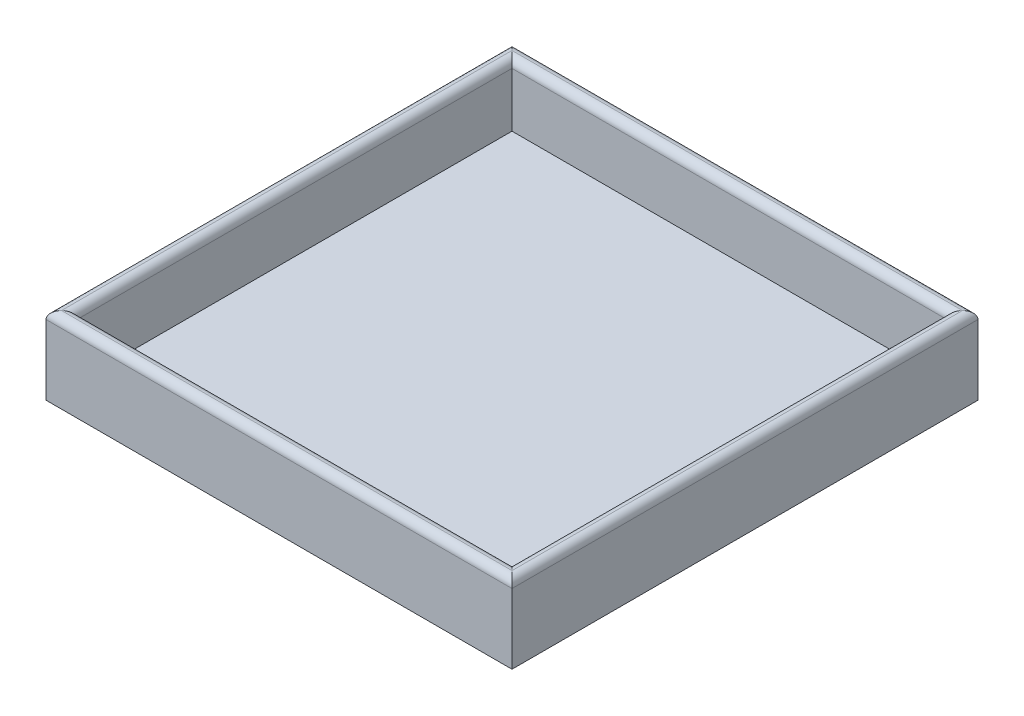
ISO-10303-21;
HEADER;
FILE_DESCRIPTION(('STEP AP214'),'2;1');
FILE_NAME('part.step','',(''),(''),'','','');
FILE_SCHEMA(('AUTOMOTIVE_DESIGN { 1 0 10303 214 1 1 1 1 }'));
ENDSEC;
DATA;
#1=APPLICATION_CONTEXT('core data for automotive mechanical design processes');
#2=APPLICATION_PROTOCOL_DEFINITION('international standard','automotive_design',2000,#1);
#3=PRODUCT_CONTEXT('',#1,'mechanical');
#4=PRODUCT('Part','Part','',(#3));
#5=PRODUCT_RELATED_PRODUCT_CATEGORY('part','',(#4));
#6=PRODUCT_DEFINITION_FORMATION('','',#4);
#7=PRODUCT_DEFINITION_CONTEXT('part definition',#1,'design');
#8=PRODUCT_DEFINITION('design','',#6,#7);
#9=PRODUCT_DEFINITION_SHAPE('','',#8);
#10=(LENGTH_UNIT() NAMED_UNIT(*) SI_UNIT(.MILLI.,.METRE.));
#11=(NAMED_UNIT(*) PLANE_ANGLE_UNIT() SI_UNIT($,.RADIAN.));
#12=(NAMED_UNIT(*) SI_UNIT($,.STERADIAN.) SOLID_ANGLE_UNIT());
#13=UNCERTAINTY_MEASURE_WITH_UNIT(LENGTH_MEASURE(1.E-05),#10,'distance_accuracy_value','');
#14=(GEOMETRIC_REPRESENTATION_CONTEXT(3) GLOBAL_UNCERTAINTY_ASSIGNED_CONTEXT((#13)) GLOBAL_UNIT_ASSIGNED_CONTEXT((#10,
#11,#12)) REPRESENTATION_CONTEXT('',''));
#15=CARTESIAN_POINT('',(0.,0.,0.));
#16=DIRECTION('',(0.,0.,1.));
#17=DIRECTION('',(1.,0.,0.));
#18=AXIS2_PLACEMENT_3D('',#15,#16,#17);
#19=CARTESIAN_POINT('',(0.,50.,0.));
#20=DIRECTION('',(-1.,0.,0.));
#21=DIRECTION('',(0.,0.,1.));
#22=AXIS2_PLACEMENT_3D('',#19,#20,#21);
#23=PLANE('',#22);
#24=DIRECTION('',(0.,-1.,0.));
#25=VECTOR('',#24,1.);
#26=CARTESIAN_POINT('',(0.,50.,0.));
#27=LINE('',#26,#25);
#28=CARTESIAN_POINT('',(0.,45.,0.));
#29=VERTEX_POINT('',#28);
#30=CARTESIAN_POINT('',(0.,0.,0.));
#31=VERTEX_POINT('',#30);
#32=EDGE_CURVE('E261',#29,#31,#27,.T.);
#33=ORIENTED_EDGE('',*,*,#32,.F.);
#34=DIRECTION('',(0.,0.,-1.));
#35=VECTOR('',#34,1.);
#36=CARTESIAN_POINT('',(0.,45.,-300.));
#37=LINE('',#36,#35);
#38=CARTESIAN_POINT('',(0.,45.,-300.));
#39=VERTEX_POINT('',#38);
#40=EDGE_CURVE('E174',#29,#39,#37,.T.);
#41=ORIENTED_EDGE('',*,*,#40,.T.);
#42=DIRECTION('',(0.,-1.,0.));
#43=VECTOR('',#42,1.);
#44=CARTESIAN_POINT('',(0.,50.,-300.));
#45=LINE('',#44,#43);
#46=CARTESIAN_POINT('',(0.,0.,-300.));
#47=VERTEX_POINT('',#46);
#48=EDGE_CURVE('E260',#39,#47,#45,.T.);
#49=ORIENTED_EDGE('',*,*,#48,.T.);
#50=DIRECTION('',(0.,0.,-1.));
#51=VECTOR('',#50,1.);
#52=CARTESIAN_POINT('',(0.,0.,0.));
#53=LINE('',#52,#51);
#54=EDGE_CURVE('E161',#31,#47,#53,.T.);
#55=ORIENTED_EDGE('',*,*,#54,.F.);
#56=EDGE_LOOP('',(#33,#41,#49,#55));
#57=FACE_BOUND('',#56,.T.);
#58=ADVANCED_FACE('F63',(#57),#23,.T.);
#59=CARTESIAN_POINT('',(0.,50.,0.));
#60=DIRECTION('',(0.,0.,-1.));
#61=DIRECTION('',(-1.,0.,0.));
#62=AXIS2_PLACEMENT_3D('',#59,#60,#61);
#63=PLANE('',#62);
#64=DIRECTION('',(0.,-1.,0.));
#65=VECTOR('',#64,1.);
#66=CARTESIAN_POINT('',(300.,50.,0.));
#67=LINE('',#66,#65);
#68=CARTESIAN_POINT('',(300.,45.,0.));
#69=VERTEX_POINT('',#68);
#70=CARTESIAN_POINT('',(300.,0.,0.));
#71=VERTEX_POINT('',#70);
#72=EDGE_CURVE('E265',#69,#71,#67,.T.);
#73=ORIENTED_EDGE('',*,*,#72,.F.);
#74=DIRECTION('',(1.,0.,0.));
#75=VECTOR('',#74,1.);
#76=CARTESIAN_POINT('',(0.,45.,0.));
#77=LINE('',#76,#75);
#78=EDGE_CURVE('E179',#69,#29,#77,.F.);
#79=ORIENTED_EDGE('',*,*,#78,.T.);
#80=ORIENTED_EDGE('',*,*,#32,.T.);
#81=DIRECTION('',(1.,0.,0.));
#82=VECTOR('',#81,1.);
#83=CARTESIAN_POINT('',(0.,0.,0.));
#84=LINE('',#83,#82);
#85=EDGE_CURVE('E256',#31,#71,#84,.T.);
#86=ORIENTED_EDGE('',*,*,#85,.T.);
#87=EDGE_LOOP('',(#73,#79,#80,#86));
#88=FACE_BOUND('',#87,.T.);
#89=ADVANCED_FACE('F283',(#88),#63,.F.);
#90=CARTESIAN_POINT('',(300.,50.,0.));
#91=DIRECTION('',(-1.,0.,0.));
#92=DIRECTION('',(0.,0.,1.));
#93=AXIS2_PLACEMENT_3D('',#90,#91,#92);
#94=PLANE('',#93);
#95=DIRECTION('',(0.,-1.,0.));
#96=VECTOR('',#95,1.);
#97=CARTESIAN_POINT('',(300.,50.,-300.));
#98=LINE('',#97,#96);
#99=CARTESIAN_POINT('',(300.,45.,-300.));
#100=VERTEX_POINT('',#99);
#101=CARTESIAN_POINT('',(300.,0.,-300.));
#102=VERTEX_POINT('',#101);
#103=EDGE_CURVE('E268',#100,#102,#98,.T.);
#104=ORIENTED_EDGE('',*,*,#103,.F.);
#105=DIRECTION('',(0.,0.,-1.));
#106=VECTOR('',#105,1.);
#107=CARTESIAN_POINT('',(300.,45.,0.));
#108=LINE('',#107,#106);
#109=EDGE_CURVE('E276',#100,#69,#108,.F.);
#110=ORIENTED_EDGE('',*,*,#109,.T.);
#111=ORIENTED_EDGE('',*,*,#72,.T.);
#112=DIRECTION('',(0.,0.,-1.));
#113=VECTOR('',#112,1.);
#114=CARTESIAN_POINT('',(300.,0.,0.));
#115=LINE('',#114,#113);
#116=EDGE_CURVE('E252',#71,#102,#115,.T.);
#117=ORIENTED_EDGE('',*,*,#116,.T.);
#118=EDGE_LOOP('',(#104,#110,#111,#117));
#119=FACE_BOUND('',#118,.T.);
#120=ADVANCED_FACE('F304',(#119),#94,.F.);
#121=CARTESIAN_POINT('',(0.,50.,-300.));
#122=DIRECTION('',(0.,0.,-1.));
#123=DIRECTION('',(-1.,0.,0.));
#124=AXIS2_PLACEMENT_3D('',#121,#122,#123);
#125=PLANE('',#124);
#126=ORIENTED_EDGE('',*,*,#48,.F.);
#127=DIRECTION('',(1.,0.,0.));
#128=VECTOR('',#127,1.);
#129=CARTESIAN_POINT('',(300.,45.,-300.));
#130=LINE('',#129,#128);
#131=EDGE_CURVE('E264',#39,#100,#130,.T.);
#132=ORIENTED_EDGE('',*,*,#131,.T.);
#133=ORIENTED_EDGE('',*,*,#103,.T.);
#134=DIRECTION('',(1.,0.,0.));
#135=VECTOR('',#134,1.);
#136=CARTESIAN_POINT('',(0.,0.,-300.));
#137=LINE('',#136,#135);
#138=EDGE_CURVE('E248',#47,#102,#137,.T.);
#139=ORIENTED_EDGE('',*,*,#138,.F.);
#140=EDGE_LOOP('',(#126,#132,#133,#139));
#141=FACE_BOUND('',#140,.T.);
#142=ADVANCED_FACE('F301',(#141),#125,.T.);
#143=CARTESIAN_POINT('',(0.,0.,0.));
#144=DIRECTION('',(0.,-1.,0.));
#145=DIRECTION('',(0.,0.,-1.));
#146=AXIS2_PLACEMENT_3D('',#143,#144,#145);
#147=PLANE('',#146);
#148=ORIENTED_EDGE('',*,*,#54,.T.);
#149=ORIENTED_EDGE('',*,*,#138,.T.);
#150=ORIENTED_EDGE('',*,*,#116,.F.);
#151=ORIENTED_EDGE('',*,*,#85,.F.);
#152=EDGE_LOOP('',(#148,#149,#150,#151));
#153=FACE_BOUND('',#152,.T.);
#154=ADVANCED_FACE('F307',(#153),#147,.T.);
#155=CARTESIAN_POINT('',(10.,10.,0.));
#156=DIRECTION('',(-1.,0.,0.));
#157=DIRECTION('',(0.,0.,1.));
#158=AXIS2_PLACEMENT_3D('',#155,#156,#157);
#159=PLANE('',#158);
#160=DIRECTION('',(0.,1.,0.));
#161=VECTOR('',#160,1.);
#162=CARTESIAN_POINT('',(10.,10.,-290.));
#163=LINE('',#162,#161);
#164=CARTESIAN_POINT('',(10.,10.,-290.));
#165=VERTEX_POINT('',#164);
#166=CARTESIAN_POINT('',(10.,45.,-290.));
#167=VERTEX_POINT('',#166);
#168=EDGE_CURVE('E240',#165,#167,#163,.T.);
#169=ORIENTED_EDGE('',*,*,#168,.T.);
#170=DIRECTION('',(0.,0.,1.));
#171=VECTOR('',#170,1.);
#172=CARTESIAN_POINT('',(10.,45.,0.));
#173=LINE('',#172,#171);
#174=CARTESIAN_POINT('',(10.,45.,-10.));
#175=VERTEX_POINT('',#174);
#176=EDGE_CURVE('E74',#167,#175,#173,.T.);
#177=ORIENTED_EDGE('',*,*,#176,.T.);
#178=DIRECTION('',(0.,1.,0.));
#179=VECTOR('',#178,1.);
#180=CARTESIAN_POINT('',(10.,10.,-10.));
#181=LINE('',#180,#179);
#182=CARTESIAN_POINT('',(10.,10.,-10.));
#183=VERTEX_POINT('',#182);
#184=EDGE_CURVE('E153',#183,#175,#181,.T.);
#185=ORIENTED_EDGE('',*,*,#184,.F.);
#186=DIRECTION('',(0.,0.,1.));
#187=VECTOR('',#186,1.);
#188=CARTESIAN_POINT('',(10.,10.,0.));
#189=LINE('',#188,#187);
#190=EDGE_CURVE('E229',#165,#183,#189,.T.);
#191=ORIENTED_EDGE('',*,*,#190,.F.);
#192=EDGE_LOOP('',(#169,#177,#185,#191));
#193=FACE_BOUND('',#192,.T.);
#194=ADVANCED_FACE('F309',(#193),#159,.F.);
#195=CARTESIAN_POINT('',(0.,10.,-10.));
#196=DIRECTION('',(0.,0.,1.));
#197=DIRECTION('',(1.,0.,0.));
#198=AXIS2_PLACEMENT_3D('',#195,#196,#197);
#199=PLANE('',#198);
#200=ORIENTED_EDGE('',*,*,#184,.T.);
#201=DIRECTION('',(1.,0.,0.));
#202=VECTOR('',#201,1.);
#203=CARTESIAN_POINT('',(0.,45.,-10.));
#204=LINE('',#203,#202);
#205=CARTESIAN_POINT('',(290.,45.,-10.));
#206=VERTEX_POINT('',#205);
#207=EDGE_CURVE('E12',#175,#206,#204,.T.);
#208=ORIENTED_EDGE('',*,*,#207,.T.);
#209=DIRECTION('',(0.,1.,0.));
#210=VECTOR('',#209,1.);
#211=CARTESIAN_POINT('',(290.,10.,-10.));
#212=LINE('',#211,#210);
#213=CARTESIAN_POINT('',(290.,10.,-10.));
#214=VERTEX_POINT('',#213);
#215=EDGE_CURVE('E152',#214,#206,#212,.T.);
#216=ORIENTED_EDGE('',*,*,#215,.F.);
#217=DIRECTION('',(1.,0.,0.));
#218=VECTOR('',#217,1.);
#219=CARTESIAN_POINT('',(0.,10.,-10.));
#220=LINE('',#219,#218);
#221=EDGE_CURVE('E235',#183,#214,#220,.T.);
#222=ORIENTED_EDGE('',*,*,#221,.F.);
#223=EDGE_LOOP('',(#200,#208,#216,#222));
#224=FACE_BOUND('',#223,.T.);
#225=ADVANCED_FACE('F150',(#224),#199,.F.);
#226=CARTESIAN_POINT('',(290.,10.,0.));
#227=DIRECTION('',(1.,0.,0.));
#228=DIRECTION('',(0.,0.,-1.));
#229=AXIS2_PLACEMENT_3D('',#226,#227,#228);
#230=PLANE('',#229);
#231=ORIENTED_EDGE('',*,*,#215,.T.);
#232=DIRECTION('',(0.,0.,-1.));
#233=VECTOR('',#232,1.);
#234=CARTESIAN_POINT('',(290.,45.,0.));
#235=LINE('',#234,#233);
#236=CARTESIAN_POINT('',(290.,45.,-290.));
#237=VERTEX_POINT('',#236);
#238=EDGE_CURVE('E156',#206,#237,#235,.T.);
#239=ORIENTED_EDGE('',*,*,#238,.T.);
#240=DIRECTION('',(0.,1.,0.));
#241=VECTOR('',#240,1.);
#242=CARTESIAN_POINT('',(290.,10.,-290.));
#243=LINE('',#242,#241);
#244=CARTESIAN_POINT('',(290.,10.,-290.));
#245=VERTEX_POINT('',#244);
#246=EDGE_CURVE('E112',#245,#237,#243,.T.);
#247=ORIENTED_EDGE('',*,*,#246,.F.);
#248=DIRECTION('',(0.,0.,-1.));
#249=VECTOR('',#248,1.);
#250=CARTESIAN_POINT('',(290.,10.,0.));
#251=LINE('',#250,#249);
#252=EDGE_CURVE('E158',#214,#245,#251,.T.);
#253=ORIENTED_EDGE('',*,*,#252,.F.);
#254=EDGE_LOOP('',(#231,#239,#247,#253));
#255=FACE_BOUND('',#254,.T.);
#256=ADVANCED_FACE('F154',(#255),#230,.F.);
#257=CARTESIAN_POINT('',(0.,10.,-290.));
#258=DIRECTION('',(0.,0.,-1.));
#259=DIRECTION('',(-1.,0.,0.));
#260=AXIS2_PLACEMENT_3D('',#257,#258,#259);
#261=PLANE('',#260);
#262=ORIENTED_EDGE('',*,*,#246,.T.);
#263=DIRECTION('',(-1.,0.,0.));
#264=VECTOR('',#263,1.);
#265=CARTESIAN_POINT('',(0.,45.,-290.));
#266=LINE('',#265,#264);
#267=EDGE_CURVE('E173',#237,#167,#266,.T.);
#268=ORIENTED_EDGE('',*,*,#267,.T.);
#269=ORIENTED_EDGE('',*,*,#168,.F.);
#270=DIRECTION('',(-1.,0.,0.));
#271=VECTOR('',#270,1.);
#272=CARTESIAN_POINT('',(0.,10.,-290.));
#273=LINE('',#272,#271);
#274=EDGE_CURVE('E224',#245,#165,#273,.T.);
#275=ORIENTED_EDGE('',*,*,#274,.F.);
#276=EDGE_LOOP('',(#262,#268,#269,#275));
#277=FACE_BOUND('',#276,.T.);
#278=ADVANCED_FACE('F350',(#277),#261,.F.);
#279=CARTESIAN_POINT('',(0.,10.,0.));
#280=DIRECTION('',(0.,1.,0.));
#281=DIRECTION('',(0.,0.,1.));
#282=AXIS2_PLACEMENT_3D('',#279,#280,#281);
#283=PLANE('',#282);
#284=ORIENTED_EDGE('',*,*,#252,.T.);
#285=ORIENTED_EDGE('',*,*,#274,.T.);
#286=ORIENTED_EDGE('',*,*,#190,.T.);
#287=ORIENTED_EDGE('',*,*,#221,.T.);
#288=EDGE_LOOP('',(#284,#285,#286,#287));
#289=FACE_BOUND('',#288,.T.);
#290=ADVANCED_FACE('F346',(#289),#283,.T.);
#291=CARTESIAN_POINT('',(0.,45.,-5.));
#292=DIRECTION('',(1.,0.,0.));
#293=DIRECTION('',(0.,0.,-1.));
#294=AXIS2_PLACEMENT_3D('',#291,#292,#293);
#295=CYLINDRICAL_SURFACE('',#294,5.);
#296=CARTESIAN_POINT('',(295.,45.,-5.));
#297=DIRECTION('',(0.707106781186547,0.,-0.707106781186547));
#298=DIRECTION('',(-0.707106781186547,0.,-0.707106781186547));
#299=AXIS2_PLACEMENT_3D('',#296,#297,#298);
#300=ELLIPSE('',#299,7.07106781186547,5.);
#301=CARTESIAN_POINT('',(295.,50.,-5.));
#302=VERTEX_POINT('',#301);
#303=EDGE_CURVE('E163',#206,#302,#300,.T.);
#304=ORIENTED_EDGE('',*,*,#303,.F.);
#305=ORIENTED_EDGE('',*,*,#207,.F.);
#306=CARTESIAN_POINT('',(5.,45.,-5.));
#307=DIRECTION('',(0.707106781186547,0.,0.707106781186547));
#308=DIRECTION('',(-0.707106781186547,0.,0.707106781186547));
#309=AXIS2_PLACEMENT_3D('',#306,#307,#308);
#310=ELLIPSE('',#309,7.07106781186547,5.);
#311=CARTESIAN_POINT('',(5.,50.,-5.));
#312=VERTEX_POINT('',#311);
#313=EDGE_CURVE('E67',#312,#175,#310,.F.);
#314=ORIENTED_EDGE('',*,*,#313,.F.);
#315=DIRECTION('',(1.,0.,0.));
#316=VECTOR('',#315,1.);
#317=CARTESIAN_POINT('',(0.,50.,-5.));
#318=LINE('',#317,#316);
#319=EDGE_CURVE('E100',#302,#312,#318,.F.);
#320=ORIENTED_EDGE('',*,*,#319,.F.);
#321=EDGE_LOOP('',(#304,#305,#314,#320));
#322=FACE_BOUND('',#321,.T.);
#323=ADVANCED_FACE('F65',(#322),#295,.T.);
#324=CARTESIAN_POINT('',(5.,45.,0.));
#325=DIRECTION('',(0.,0.,1.));
#326=DIRECTION('',(1.,0.,0.));
#327=AXIS2_PLACEMENT_3D('',#324,#325,#326);
#328=CYLINDRICAL_SURFACE('',#327,5.);
#329=ORIENTED_EDGE('',*,*,#313,.T.);
#330=ORIENTED_EDGE('',*,*,#176,.F.);
#331=CARTESIAN_POINT('',(5.,45.,-295.));
#332=DIRECTION('',(-0.707106781186547,0.,0.707106781186547));
#333=DIRECTION('',(-0.707106781186547,0.,-0.707106781186547));
#334=AXIS2_PLACEMENT_3D('',#331,#332,#333);
#335=ELLIPSE('',#334,7.07106781186547,5.);
#336=CARTESIAN_POINT('',(5.,50.,-295.));
#337=VERTEX_POINT('',#336);
#338=EDGE_CURVE('E212',#337,#167,#335,.F.);
#339=ORIENTED_EDGE('',*,*,#338,.F.);
#340=DIRECTION('',(0.,0.,1.));
#341=VECTOR('',#340,1.);
#342=CARTESIAN_POINT('',(5.,50.,0.));
#343=LINE('',#342,#341);
#344=EDGE_CURVE('E208',#312,#337,#343,.F.);
#345=ORIENTED_EDGE('',*,*,#344,.F.);
#346=EDGE_LOOP('',(#329,#330,#339,#345));
#347=FACE_BOUND('',#346,.T.);
#348=ADVANCED_FACE('F341',(#347),#328,.T.);
#349=CARTESIAN_POINT('',(0.,45.,-5.));
#350=DIRECTION('',(1.,0.,0.));
#351=DIRECTION('',(0.,0.,-1.));
#352=AXIS2_PLACEMENT_3D('',#349,#350,#351);
#353=CYLINDRICAL_SURFACE('',#352,5.);
#354=CARTESIAN_POINT('',(295.,45.,-5.));
#355=DIRECTION('',(0.707106781186547,0.,-0.707106781186547));
#356=DIRECTION('',(0.707106781186547,0.,0.707106781186547));
#357=AXIS2_PLACEMENT_3D('',#354,#355,#356);
#358=ELLIPSE('',#357,7.07106781186547,5.);
#359=EDGE_CURVE('E200',#302,#69,#358,.T.);
#360=ORIENTED_EDGE('',*,*,#359,.F.);
#361=ORIENTED_EDGE('',*,*,#319,.T.);
#362=CARTESIAN_POINT('',(5.,45.,-5.));
#363=DIRECTION('',(0.707106781186547,0.,0.707106781186547));
#364=DIRECTION('',(-0.707106781186547,0.,0.707106781186547));
#365=AXIS2_PLACEMENT_3D('',#362,#363,#364);
#366=ELLIPSE('',#365,7.07106781186547,5.);
#367=EDGE_CURVE('E204',#29,#312,#366,.F.);
#368=ORIENTED_EDGE('',*,*,#367,.F.);
#369=ORIENTED_EDGE('',*,*,#78,.F.);
#370=EDGE_LOOP('',(#360,#361,#368,#369));
#371=FACE_BOUND('',#370,.T.);
#372=ADVANCED_FACE('F289',(#371),#353,.T.);
#373=CARTESIAN_POINT('',(295.,45.,0.));
#374=DIRECTION('',(0.,0.,-1.));
#375=DIRECTION('',(-1.,0.,0.));
#376=AXIS2_PLACEMENT_3D('',#373,#374,#375);
#377=CYLINDRICAL_SURFACE('',#376,5.);
#378=CARTESIAN_POINT('',(295.,45.,-295.));
#379=DIRECTION('',(-0.707106781186547,0.,-0.707106781186547));
#380=DIRECTION('',(0.707106781186547,0.,-0.707106781186547));
#381=AXIS2_PLACEMENT_3D('',#378,#379,#380);
#382=ELLIPSE('',#381,7.07106781186547,5.);
#383=CARTESIAN_POINT('',(295.,50.,-295.));
#384=VERTEX_POINT('',#383);
#385=EDGE_CURVE('E168',#237,#384,#382,.T.);
#386=ORIENTED_EDGE('',*,*,#385,.F.);
#387=ORIENTED_EDGE('',*,*,#238,.F.);
#388=ORIENTED_EDGE('',*,*,#303,.T.);
#389=DIRECTION('',(0.,0.,-1.));
#390=VECTOR('',#389,1.);
#391=CARTESIAN_POINT('',(295.,50.,0.));
#392=LINE('',#391,#390);
#393=EDGE_CURVE('E196',#384,#302,#392,.F.);
#394=ORIENTED_EDGE('',*,*,#393,.F.);
#395=EDGE_LOOP('',(#386,#387,#388,#394));
#396=FACE_BOUND('',#395,.T.);
#397=ADVANCED_FACE('F171',(#396),#377,.T.);
#398=CARTESIAN_POINT('',(0.,45.,-295.));
#399=DIRECTION('',(-1.,0.,0.));
#400=DIRECTION('',(0.,0.,1.));
#401=AXIS2_PLACEMENT_3D('',#398,#399,#400);
#402=CYLINDRICAL_SURFACE('',#401,5.);
#403=ORIENTED_EDGE('',*,*,#267,.F.);
#404=ORIENTED_EDGE('',*,*,#385,.T.);
#405=DIRECTION('',(-1.,0.,0.));
#406=VECTOR('',#405,1.);
#407=CARTESIAN_POINT('',(0.,50.,-295.));
#408=LINE('',#407,#406);
#409=EDGE_CURVE('E192',#337,#384,#408,.F.);
#410=ORIENTED_EDGE('',*,*,#409,.F.);
#411=ORIENTED_EDGE('',*,*,#338,.T.);
#412=EDGE_LOOP('',(#403,#404,#410,#411));
#413=FACE_BOUND('',#412,.T.);
#414=ADVANCED_FACE('F334',(#413),#402,.T.);
#415=CARTESIAN_POINT('',(5.,45.,0.));
#416=DIRECTION('',(0.,0.,1.));
#417=DIRECTION('',(1.,0.,0.));
#418=AXIS2_PLACEMENT_3D('',#415,#416,#417);
#419=CYLINDRICAL_SURFACE('',#418,5.);
#420=ORIENTED_EDGE('',*,*,#367,.T.);
#421=ORIENTED_EDGE('',*,*,#344,.T.);
#422=CARTESIAN_POINT('',(5.,45.,-295.));
#423=DIRECTION('',(-0.707106781186547,0.,0.707106781186547));
#424=DIRECTION('',(0.707106781186547,0.,0.707106781186547));
#425=AXIS2_PLACEMENT_3D('',#422,#423,#424);
#426=ELLIPSE('',#425,7.07106781186547,5.);
#427=EDGE_CURVE('E188',#39,#337,#426,.F.);
#428=ORIENTED_EDGE('',*,*,#427,.F.);
#429=ORIENTED_EDGE('',*,*,#40,.F.);
#430=EDGE_LOOP('',(#420,#421,#428,#429));
#431=FACE_BOUND('',#430,.T.);
#432=ADVANCED_FACE('F292',(#431),#419,.T.);
#433=CARTESIAN_POINT('',(295.,45.,0.));
#434=DIRECTION('',(0.,0.,-1.));
#435=DIRECTION('',(-1.,0.,0.));
#436=AXIS2_PLACEMENT_3D('',#433,#434,#435);
#437=CYLINDRICAL_SURFACE('',#436,5.);
#438=ORIENTED_EDGE('',*,*,#359,.T.);
#439=ORIENTED_EDGE('',*,*,#109,.F.);
#440=CARTESIAN_POINT('',(295.,45.,-295.));
#441=DIRECTION('',(-0.707106781186547,0.,-0.707106781186547));
#442=DIRECTION('',(0.707106781186547,0.,-0.707106781186547));
#443=AXIS2_PLACEMENT_3D('',#440,#441,#442);
#444=ELLIPSE('',#443,7.07106781186547,5.);
#445=EDGE_CURVE('E185',#384,#100,#444,.T.);
#446=ORIENTED_EDGE('',*,*,#445,.F.);
#447=ORIENTED_EDGE('',*,*,#393,.T.);
#448=EDGE_LOOP('',(#438,#439,#446,#447));
#449=FACE_BOUND('',#448,.T.);
#450=ADVANCED_FACE('F328',(#449),#437,.T.);
#451=CARTESIAN_POINT('',(0.,45.,-295.));
#452=DIRECTION('',(-1.,0.,0.));
#453=DIRECTION('',(0.,0.,1.));
#454=AXIS2_PLACEMENT_3D('',#451,#452,#453);
#455=CYLINDRICAL_SURFACE('',#454,5.);
#456=ORIENTED_EDGE('',*,*,#427,.T.);
#457=ORIENTED_EDGE('',*,*,#409,.T.);
#458=ORIENTED_EDGE('',*,*,#445,.T.);
#459=ORIENTED_EDGE('',*,*,#131,.F.);
#460=EDGE_LOOP('',(#456,#457,#458,#459));
#461=FACE_BOUND('',#460,.T.);
#462=ADVANCED_FACE('F296',(#461),#455,.T.);
#463=CLOSED_SHELL('',(#58,#89,#120,#142,#154,#194,#225,#256,#278,#290,#323,#348,#372,#397,#414,
#432,#450,#462));
#464=MANIFOLD_SOLID_BREP('B2',#463);
#465=ADVANCED_BREP_SHAPE_REPRESENTATION('',(#18,#464),#14);
#466=SHAPE_DEFINITION_REPRESENTATION(#9,#465);
ENDSEC;
END-ISO-10303-21;
